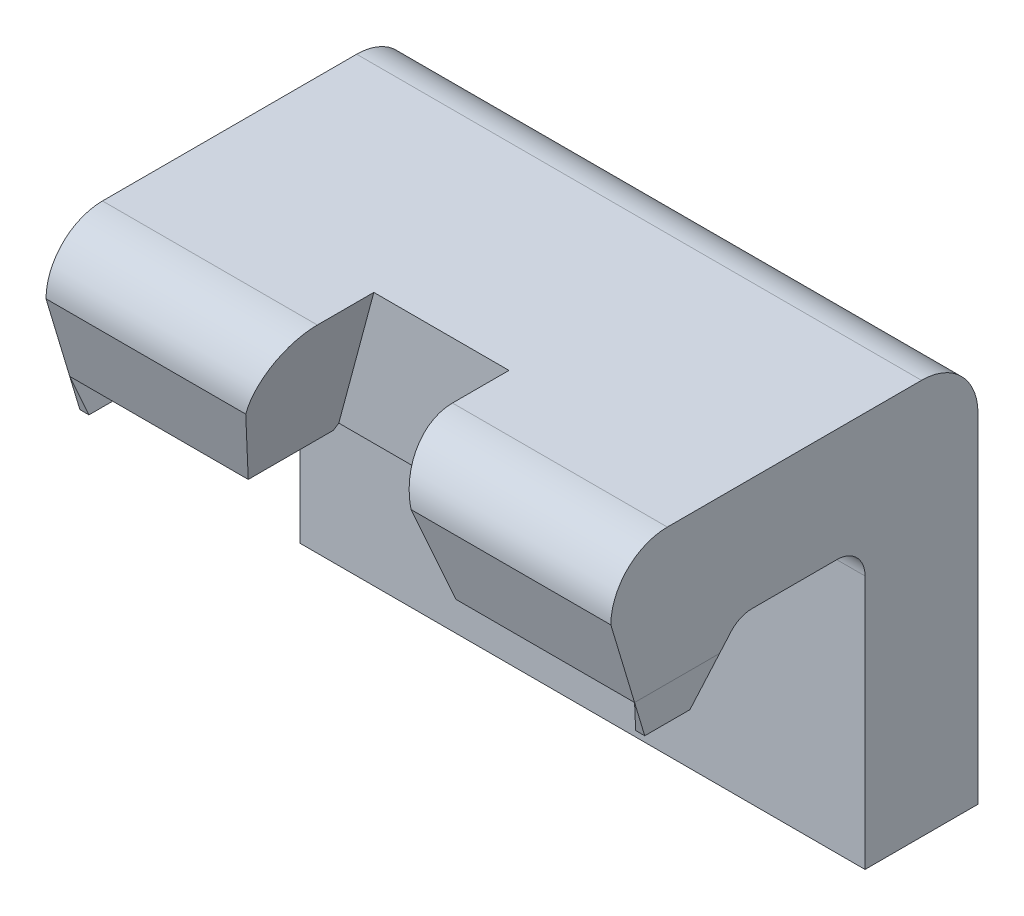
ISO-10303-21;
HEADER;
FILE_DESCRIPTION(('STEP AP214'),'2;1');
FILE_NAME('part.step','',(''),(''),'','','');
FILE_SCHEMA(('AUTOMOTIVE_DESIGN { 1 0 10303 214 1 1 1 1 }'));
ENDSEC;
DATA;
#1=APPLICATION_CONTEXT('core data for automotive mechanical design processes');
#2=APPLICATION_PROTOCOL_DEFINITION('international standard','automotive_design',2000,#1);
#3=PRODUCT_CONTEXT('',#1,'mechanical');
#4=PRODUCT('Part','Part','',(#3));
#5=PRODUCT_RELATED_PRODUCT_CATEGORY('part','',(#4));
#6=PRODUCT_DEFINITION_FORMATION('','',#4);
#7=PRODUCT_DEFINITION_CONTEXT('part definition',#1,'design');
#8=PRODUCT_DEFINITION('design','',#6,#7);
#9=PRODUCT_DEFINITION_SHAPE('','',#8);
#10=(LENGTH_UNIT() NAMED_UNIT(*) SI_UNIT(.MILLI.,.METRE.));
#11=(NAMED_UNIT(*) PLANE_ANGLE_UNIT() SI_UNIT($,.RADIAN.));
#12=(NAMED_UNIT(*) SI_UNIT($,.STERADIAN.) SOLID_ANGLE_UNIT());
#13=UNCERTAINTY_MEASURE_WITH_UNIT(LENGTH_MEASURE(1.E-05),#10,'distance_accuracy_value','');
#14=(GEOMETRIC_REPRESENTATION_CONTEXT(3) GLOBAL_UNCERTAINTY_ASSIGNED_CONTEXT((#13)) GLOBAL_UNIT_ASSIGNED_CONTEXT((#10,
#11,#12)) REPRESENTATION_CONTEXT('',''));
#15=CARTESIAN_POINT('',(0.,0.,0.));
#16=DIRECTION('',(0.,0.,1.));
#17=DIRECTION('',(1.,0.,0.));
#18=AXIS2_PLACEMENT_3D('',#15,#16,#17);
#19=CARTESIAN_POINT('',(0.2,0.4,0.45));
#20=DIRECTION('',(0.965925826288944,0.258819045102985,0.));
#21=DIRECTION('',(-0.258819045102985,0.965925826288944,0.));
#22=AXIS2_PLACEMENT_3D('',#19,#20,#21);
#23=PLANE('',#22);
#24=DIRECTION('',(0.,0.,1.));
#25=VECTOR('',#24,1.);
#26=CARTESIAN_POINT('',(0.183923048454,0.46,0.));
#27=LINE('',#26,#25);
#28=CARTESIAN_POINT('',(0.183923048454,0.459999999999874,0.457529003975784));
#29=VERTEX_POINT('',#28);
#30=CARTESIAN_POINT('',(0.183923048454,0.459999999999992,0.608000000000027));
#31=VERTEX_POINT('',#30);
#32=EDGE_CURVE('P0_E147',#29,#31,#27,.T.);
#33=ORIENTED_EDGE('',*,*,#32,.T.);
#34=DIRECTION('',(-0.248592126934948,0.927758448091751,0.278327534427235));
#35=VECTOR('',#34,1.);
#36=CARTESIAN_POINT('',(0.183923048454,0.459999999999988,0.60800000000004));
#37=LINE('',#36,#35);
#38=CARTESIAN_POINT('',(0.146410161513836,0.6,0.65));
#39=VERTEX_POINT('',#38);
#40=EDGE_CURVE('P0_E144',#31,#39,#37,.T.);
#41=ORIENTED_EDGE('',*,*,#40,.T.);
#42=CARTESIAN_POINT('',(0.146410161513672,0.6,0.55));
#43=DIRECTION('',(0.965925826288944,0.258819045102985,0.));
#44=DIRECTION('',(0.258819045102985,-0.965925826288944,0.));
#45=AXIS2_PLACEMENT_3D('',#42,#43,#44);
#46=ELLIPSE('',#45,0.103527618041022,0.1);
#47=CARTESIAN_POINT('',(0.119615242270754,0.7,0.55));
#48=VERTEX_POINT('',#47);
#49=EDGE_CURVE('P0_E20',#48,#39,#46,.T.);
#50=ORIENTED_EDGE('',*,*,#49,.F.);
#51=DIRECTION('',(0.,0.,1.));
#52=VECTOR('',#51,1.);
#53=CARTESIAN_POINT('',(0.119615242271,0.7,0.55));
#54=LINE('',#53,#52);
#55=CARTESIAN_POINT('',(0.119615242271,0.7,0.45));
#56=VERTEX_POINT('',#55);
#57=EDGE_CURVE('P0_E141',#56,#48,#54,.T.);
#58=ORIENTED_EDGE('',*,*,#57,.F.);
#59=DIRECTION('',(0.258819045101076,-0.965925826289455,0.));
#60=VECTOR('',#59,1.);
#61=CARTESIAN_POINT('',(0.119615242271,0.7,0.45));
#62=LINE('',#61,#60);
#63=CARTESIAN_POINT('',(0.181616184829,0.468609332255068,0.450000000000078));
#64=VERTEX_POINT('',#63);
#65=EDGE_CURVE('P0_E174',#56,#64,#62,.T.);
#66=ORIENTED_EDGE('',*,*,#65,.T.);
#67=DIRECTION('',(0.197718812609969,-0.737896654329067,0.645302873595085));
#68=VECTOR('',#67,1.);
#69=CARTESIAN_POINT('',(0.181616184829,0.468609332255103,0.450000000000117));
#70=LINE('',#69,#68);
#71=EDGE_CURVE('P0_E198',#64,#29,#70,.T.);
#72=ORIENTED_EDGE('',*,*,#71,.T.);
#73=EDGE_LOOP('',(#33,#41,#50,#58,#66,#72));
#74=FACE_BOUND('',#73,.T.);
#75=ADVANCED_FACE('P0_F17',(#74),#23,.F.);
#76=CARTESIAN_POINT('',(-0.2,0.4,0.45));
#77=DIRECTION('',(-0.965925826288944,0.258819045102985,0.));
#78=DIRECTION('',(-0.258819045102985,-0.965925826288944,0.));
#79=AXIS2_PLACEMENT_3D('',#76,#77,#78);
#80=PLANE('',#79);
#81=DIRECTION('',(0.197718812609969,0.737896654329067,-0.645302873595085));
#82=VECTOR('',#81,1.);
#83=CARTESIAN_POINT('',(-0.183923048454,0.459999999999811,0.457529003975784));
#84=LINE('',#83,#82);
#85=CARTESIAN_POINT('',(-0.183923048454,0.459999999999937,0.457529003975928));
#86=VERTEX_POINT('',#85);
#87=CARTESIAN_POINT('',(-0.181616184829,0.468609332255068,0.450000000000078));
#88=VERTEX_POINT('',#87);
#89=EDGE_CURVE('P0_E189',#86,#88,#84,.T.);
#90=ORIENTED_EDGE('',*,*,#89,.T.);
#91=DIRECTION('',(0.258819045101076,0.965925826289455,0.));
#92=VECTOR('',#91,1.);
#93=CARTESIAN_POINT('',(-0.181616184829,0.468609332255,0.45));
#94=LINE('',#93,#92);
#95=CARTESIAN_POINT('',(-0.119615242271,0.7,0.45));
#96=VERTEX_POINT('',#95);
#97=EDGE_CURVE('P0_E148',#88,#96,#94,.T.);
#98=ORIENTED_EDGE('',*,*,#97,.T.);
#99=DIRECTION('',(0.,0.,1.));
#100=VECTOR('',#99,1.);
#101=CARTESIAN_POINT('',(-0.119615242271,0.7,0.55));
#102=LINE('',#101,#100);
#103=CARTESIAN_POINT('',(-0.119615242270754,0.7,0.55));
#104=VERTEX_POINT('',#103);
#105=EDGE_CURVE('P0_E274',#104,#96,#102,.F.);
#106=ORIENTED_EDGE('',*,*,#105,.F.);
#107=CARTESIAN_POINT('',(-0.146410161513672,0.6,0.55));
#108=DIRECTION('',(-0.965925826288944,0.258819045102985,0.));
#109=DIRECTION('',(0.258819045102985,0.965925826288944,0.));
#110=AXIS2_PLACEMENT_3D('',#107,#108,#109);
#111=ELLIPSE('',#110,0.103527618041022,0.1);
#112=CARTESIAN_POINT('',(-0.146410161513836,0.6,0.65));
#113=VERTEX_POINT('',#112);
#114=EDGE_CURVE('P0_E166',#113,#104,#111,.T.);
#115=ORIENTED_EDGE('',*,*,#114,.F.);
#116=DIRECTION('',(-0.248592126934948,-0.927758448091751,-0.278327534427235));
#117=VECTOR('',#116,1.);
#118=CARTESIAN_POINT('',(-0.146410161514,0.6,0.65));
#119=LINE('',#118,#117);
#120=CARTESIAN_POINT('',(-0.183923048454,0.459999999999992,0.60800000000004));
#121=VERTEX_POINT('',#120);
#122=EDGE_CURVE('P0_E178',#113,#121,#119,.T.);
#123=ORIENTED_EDGE('',*,*,#122,.T.);
#124=DIRECTION('',(0.,0.,-1.));
#125=VECTOR('',#124,1.);
#126=CARTESIAN_POINT('',(-0.183923048454,0.46,0.));
#127=LINE('',#126,#125);
#128=EDGE_CURVE('P0_E181',#86,#121,#127,.F.);
#129=ORIENTED_EDGE('',*,*,#128,.F.);
#130=EDGE_LOOP('',(#90,#98,#106,#115,#123,#129));
#131=FACE_BOUND('',#130,.T.);
#132=ADVANCED_FACE('P0_F283',(#131),#80,.F.);
#133=CARTESIAN_POINT('',(0.119615242271,0.7,0.45));
#134=DIRECTION('',(0.,0.,-1.));
#135=DIRECTION('',(-1.,0.,0.));
#136=AXIS2_PLACEMENT_3D('',#133,#134,#135);
#137=PLANE('',#136);
#138=DIRECTION('',(1.,0.,0.));
#139=VECTOR('',#138,1.);
#140=CARTESIAN_POINT('',(-0.5,0.468609332255103,0.450000000000117));
#141=LINE('',#140,#139);
#142=EDGE_CURVE('P0_E191',#88,#64,#141,.T.);
#143=ORIENTED_EDGE('',*,*,#142,.T.);
#144=ORIENTED_EDGE('',*,*,#65,.F.);
#145=DIRECTION('',(1.,0.,0.));
#146=VECTOR('',#145,1.);
#147=CARTESIAN_POINT('',(-0.5,0.7,0.45));
#148=LINE('',#147,#146);
#149=EDGE_CURVE('P0_E162',#96,#56,#148,.T.);
#150=ORIENTED_EDGE('',*,*,#149,.F.);
#151=ORIENTED_EDGE('',*,*,#97,.F.);
#152=EDGE_LOOP('',(#143,#144,#150,#151));
#153=FACE_BOUND('',#152,.T.);
#154=ADVANCED_FACE('P0_F288',(#153),#137,.F.);
#155=CARTESIAN_POINT('',(-0.5,0.6,0.55));
#156=DIRECTION('',(1.,0.,0.));
#157=DIRECTION('',(0.,0.,-1.));
#158=AXIS2_PLACEMENT_3D('',#155,#156,#157);
#159=CYLINDRICAL_SURFACE('',#158,0.1);
#160=CARTESIAN_POINT('',(0.5,0.6,0.55));
#161=DIRECTION('',(1.,0.,0.));
#162=DIRECTION('',(0.,0.,-1.));
#163=AXIS2_PLACEMENT_3D('',#160,#161,#162);
#164=CIRCLE('',#163,0.1);
#165=CARTESIAN_POINT('',(0.5,0.6,0.65));
#166=VERTEX_POINT('',#165);
#167=CARTESIAN_POINT('',(0.5,0.7,0.55));
#168=VERTEX_POINT('',#167);
#169=EDGE_CURVE('P0_E153',#166,#168,#164,.F.);
#170=ORIENTED_EDGE('',*,*,#169,.T.);
#171=DIRECTION('',(1.,0.,0.));
#172=VECTOR('',#171,1.);
#173=CARTESIAN_POINT('',(-0.5,0.7,0.55));
#174=LINE('',#173,#172);
#175=EDGE_CURVE('P0_E150',#48,#168,#174,.T.);
#176=ORIENTED_EDGE('',*,*,#175,.F.);
#177=ORIENTED_EDGE('',*,*,#49,.T.);
#178=DIRECTION('',(1.,0.,0.));
#179=VECTOR('',#178,1.);
#180=CARTESIAN_POINT('',(-0.5,0.6,0.65));
#181=LINE('',#180,#179);
#182=EDGE_CURVE('P0_E195',#39,#166,#181,.T.);
#183=ORIENTED_EDGE('',*,*,#182,.T.);
#184=EDGE_LOOP('',(#170,#176,#177,#183));
#185=FACE_BOUND('',#184,.T.);
#186=ADVANCED_FACE('P0_F151',(#185),#159,.T.);
#187=CARTESIAN_POINT('',(0.,0.46,0.));
#188=DIRECTION('',(0.,1.,0.));
#189=DIRECTION('',(0.,0.,1.));
#190=AXIS2_PLACEMENT_3D('',#187,#188,#189);
#191=PLANE('',#190);
#192=DIRECTION('',(0.,0.,1.));
#193=VECTOR('',#192,1.);
#194=CARTESIAN_POINT('',(0.5,0.46,0.25));
#195=LINE('',#194,#193);
#196=CARTESIAN_POINT('',(0.5,0.459999999999937,0.457529003975928));
#197=VERTEX_POINT('',#196);
#198=CARTESIAN_POINT('',(0.5,0.459999999999996,0.608000000000014));
#199=VERTEX_POINT('',#198);
#200=EDGE_CURVE('P0_E266',#197,#199,#195,.T.);
#201=ORIENTED_EDGE('',*,*,#200,.T.);
#202=DIRECTION('',(1.,0.,0.));
#203=VECTOR('',#202,1.);
#204=CARTESIAN_POINT('',(-0.5,0.459999999999988,0.60800000000004));
#205=LINE('',#204,#203);
#206=EDGE_CURVE('P0_E208',#199,#31,#205,.F.);
#207=ORIENTED_EDGE('',*,*,#206,.T.);
#208=ORIENTED_EDGE('',*,*,#32,.F.);
#209=DIRECTION('',(1.,0.,0.));
#210=VECTOR('',#209,1.);
#211=CARTESIAN_POINT('',(-0.5,0.459999999999811,0.457529003975784));
#212=LINE('',#211,#210);
#213=EDGE_CURVE('P0_E200',#29,#197,#212,.T.);
#214=ORIENTED_EDGE('',*,*,#213,.T.);
#215=EDGE_LOOP('',(#201,#207,#208,#214));
#216=FACE_BOUND('',#215,.T.);
#217=ADVANCED_FACE('P0_F517',(#216),#191,.F.);
#218=CARTESIAN_POINT('',(-0.5,0.6,0.65));
#219=DIRECTION('',(0.,0.28734788556607,-0.957826285221234));
#220=DIRECTION('',(0.,0.957826285221234,0.28734788556607));
#221=AXIS2_PLACEMENT_3D('',#218,#219,#220);
#222=PLANE('',#221);
#223=ORIENTED_EDGE('',*,*,#206,.F.);
#224=DIRECTION('',(0.,0.957826285221151,0.287347885566346));
#225=VECTOR('',#224,1.);
#226=CARTESIAN_POINT('',(0.5,0.46,0.608));
#227=LINE('',#226,#225);
#228=EDGE_CURVE('P0_E268',#199,#166,#227,.T.);
#229=ORIENTED_EDGE('',*,*,#228,.T.);
#230=ORIENTED_EDGE('',*,*,#182,.F.);
#231=ORIENTED_EDGE('',*,*,#40,.F.);
#232=EDGE_LOOP('',(#223,#229,#230,#231));
#233=FACE_BOUND('',#232,.T.);
#234=ADVANCED_FACE('P0_F509',(#233),#222,.F.);
#235=CARTESIAN_POINT('',(-0.5,0.4,0.51));
#236=DIRECTION('',(0.,0.658298490474855,0.752756997601834));
#237=DIRECTION('',(0.,-0.752756997601834,0.658298490474855));
#238=AXIS2_PLACEMENT_3D('',#235,#236,#237);
#239=PLANE('',#238);
#240=DIRECTION('',(0.,-0.752756997602527,0.658298490474063));
#241=VECTOR('',#240,1.);
#242=CARTESIAN_POINT('',(-0.5,0.480327505632,0.439752262856));
#243=LINE('',#242,#241);
#244=CARTESIAN_POINT('',(-0.5,0.48032750563368,0.439752262854322));
#245=VERTEX_POINT('',#244);
#246=CARTESIAN_POINT('',(-0.5,0.46,0.457529003976));
#247=VERTEX_POINT('',#246);
#248=EDGE_CURVE('P0_E254',#245,#247,#243,.T.);
#249=ORIENTED_EDGE('',*,*,#248,.F.);
#250=DIRECTION('',(1.,0.,0.));
#251=VECTOR('',#250,1.);
#252=CARTESIAN_POINT('',(-0.5,0.480327505631809,0.43975226285575));
#253=LINE('',#252,#251);
#254=CARTESIAN_POINT('',(0.5,0.48032750563368,0.439752262854322));
#255=VERTEX_POINT('',#254);
#256=EDGE_CURVE('P0_E305',#245,#255,#253,.T.);
#257=ORIENTED_EDGE('',*,*,#256,.T.);
#258=DIRECTION('',(0.,-0.752756997602527,0.658298490474063));
#259=VECTOR('',#258,1.);
#260=CARTESIAN_POINT('',(0.5,0.480327505632,0.439752262856));
#261=LINE('',#260,#259);
#262=EDGE_CURVE('P0_E231',#255,#197,#261,.T.);
#263=ORIENTED_EDGE('',*,*,#262,.T.);
#264=ORIENTED_EDGE('',*,*,#213,.F.);
#265=ORIENTED_EDGE('',*,*,#71,.F.);
#266=ORIENTED_EDGE('',*,*,#142,.F.);
#267=ORIENTED_EDGE('',*,*,#89,.F.);
#268=DIRECTION('',(1.,0.,0.));
#269=VECTOR('',#268,1.);
#270=CARTESIAN_POINT('',(0.,0.46,0.457529003976));
#271=LINE('',#270,#269);
#272=EDGE_CURVE('P0_E186',#247,#86,#271,.T.);
#273=ORIENTED_EDGE('',*,*,#272,.F.);
#274=EDGE_LOOP('',(#249,#257,#263,#264,#265,#266,#267,#273));
#275=FACE_BOUND('',#274,.T.);
#276=ADVANCED_FACE('P0_F370',(#275),#239,.F.);
#277=CARTESIAN_POINT('',(0.,0.46,0.));
#278=DIRECTION('',(0.,-1.,0.));
#279=DIRECTION('',(0.,0.,-1.));
#280=AXIS2_PLACEMENT_3D('',#277,#278,#279);
#281=PLANE('',#280);
#282=DIRECTION('',(1.,0.,0.));
#283=VECTOR('',#282,1.);
#284=CARTESIAN_POINT('',(-0.5,0.459999999999988,0.60800000000004));
#285=LINE('',#284,#283);
#286=CARTESIAN_POINT('',(-0.5,0.459999999999996,0.608000000000014));
#287=VERTEX_POINT('',#286);
#288=EDGE_CURVE('P0_E180',#121,#287,#285,.F.);
#289=ORIENTED_EDGE('',*,*,#288,.T.);
#290=DIRECTION('',(0.,0.,1.));
#291=VECTOR('',#290,1.);
#292=CARTESIAN_POINT('',(-0.5,0.46,0.25));
#293=LINE('',#292,#291);
#294=EDGE_CURVE('P0_E251',#247,#287,#293,.T.);
#295=ORIENTED_EDGE('',*,*,#294,.F.);
#296=ORIENTED_EDGE('',*,*,#272,.T.);
#297=ORIENTED_EDGE('',*,*,#128,.T.);
#298=EDGE_LOOP('',(#289,#295,#296,#297));
#299=FACE_BOUND('',#298,.T.);
#300=ADVANCED_FACE('P0_F373',(#299),#281,.T.);
#301=CARTESIAN_POINT('',(-0.5,0.6,0.65));
#302=DIRECTION('',(0.,0.28734788556607,-0.957826285221234));
#303=DIRECTION('',(0.,0.957826285221234,0.28734788556607));
#304=AXIS2_PLACEMENT_3D('',#301,#302,#303);
#305=PLANE('',#304);
#306=ORIENTED_EDGE('',*,*,#122,.F.);
#307=DIRECTION('',(1.,0.,0.));
#308=VECTOR('',#307,1.);
#309=CARTESIAN_POINT('',(-0.5,0.6,0.65));
#310=LINE('',#309,#308);
#311=CARTESIAN_POINT('',(-0.5,0.6,0.65));
#312=VERTEX_POINT('',#311);
#313=EDGE_CURVE('P0_E163',#312,#113,#310,.T.);
#314=ORIENTED_EDGE('',*,*,#313,.F.);
#315=DIRECTION('',(0.,0.957826285221151,0.287347885566346));
#316=VECTOR('',#315,1.);
#317=CARTESIAN_POINT('',(-0.5,0.46,0.608));
#318=LINE('',#317,#316);
#319=EDGE_CURVE('P0_E227',#287,#312,#318,.T.);
#320=ORIENTED_EDGE('',*,*,#319,.F.);
#321=ORIENTED_EDGE('',*,*,#288,.F.);
#322=EDGE_LOOP('',(#306,#314,#320,#321));
#323=FACE_BOUND('',#322,.T.);
#324=ADVANCED_FACE('P0_F376',(#323),#305,.F.);
#325=CARTESIAN_POINT('',(-0.5,0.6,0.55));
#326=DIRECTION('',(1.,0.,0.));
#327=DIRECTION('',(0.,0.,-1.));
#328=AXIS2_PLACEMENT_3D('',#325,#326,#327);
#329=CYLINDRICAL_SURFACE('',#328,0.1);
#330=CARTESIAN_POINT('',(-0.5,0.6,0.55));
#331=DIRECTION('',(1.,0.,0.));
#332=DIRECTION('',(0.,0.,-1.));
#333=AXIS2_PLACEMENT_3D('',#330,#331,#332);
#334=CIRCLE('',#333,0.1);
#335=CARTESIAN_POINT('',(-0.5,0.7,0.55));
#336=VERTEX_POINT('',#335);
#337=EDGE_CURVE('P0_E224',#312,#336,#334,.F.);
#338=ORIENTED_EDGE('',*,*,#337,.F.);
#339=ORIENTED_EDGE('',*,*,#313,.T.);
#340=ORIENTED_EDGE('',*,*,#114,.T.);
#341=DIRECTION('',(1.,0.,0.));
#342=VECTOR('',#341,1.);
#343=CARTESIAN_POINT('',(-0.5,0.7,0.55));
#344=LINE('',#343,#342);
#345=EDGE_CURVE('P0_E156',#336,#104,#344,.T.);
#346=ORIENTED_EDGE('',*,*,#345,.F.);
#347=EDGE_LOOP('',(#338,#339,#340,#346));
#348=FACE_BOUND('',#347,.T.);
#349=ADVANCED_FACE('P0_F377',(#348),#329,.T.);
#350=CARTESIAN_POINT('',(-0.5,0.7,0.55));
#351=DIRECTION('',(0.,1.,0.));
#352=DIRECTION('',(0.,0.,1.));
#353=AXIS2_PLACEMENT_3D('',#350,#351,#352);
#354=PLANE('',#353);
#355=ORIENTED_EDGE('',*,*,#105,.T.);
#356=ORIENTED_EDGE('',*,*,#149,.T.);
#357=ORIENTED_EDGE('',*,*,#57,.T.);
#358=ORIENTED_EDGE('',*,*,#175,.T.);
#359=DIRECTION('',(0.,0.,1.));
#360=VECTOR('',#359,1.);
#361=CARTESIAN_POINT('',(0.5,0.7,0.25));
#362=LINE('',#361,#360);
#363=CARTESIAN_POINT('',(0.5,0.7,0.1));
#364=VERTEX_POINT('',#363);
#365=EDGE_CURVE('P0_E238',#168,#364,#362,.F.);
#366=ORIENTED_EDGE('',*,*,#365,.T.);
#367=DIRECTION('',(1.,0.,0.));
#368=VECTOR('',#367,1.);
#369=CARTESIAN_POINT('',(-0.5,0.7,0.1));
#370=LINE('',#369,#368);
#371=CARTESIAN_POINT('',(-0.5,0.7,0.1));
#372=VERTEX_POINT('',#371);
#373=EDGE_CURVE('P0_E239',#372,#364,#370,.T.);
#374=ORIENTED_EDGE('',*,*,#373,.F.);
#375=DIRECTION('',(0.,0.,1.));
#376=VECTOR('',#375,1.);
#377=CARTESIAN_POINT('',(-0.5,0.7,0.25));
#378=LINE('',#377,#376);
#379=EDGE_CURVE('P0_E223',#336,#372,#378,.F.);
#380=ORIENTED_EDGE('',*,*,#379,.F.);
#381=ORIENTED_EDGE('',*,*,#345,.T.);
#382=EDGE_LOOP('',(#355,#356,#357,#358,#366,#374,#380,#381));
#383=FACE_BOUND('',#382,.T.);
#384=ADVANCED_FACE('P0_F160',(#383),#354,.T.);
#385=CARTESIAN_POINT('',(-0.5,0.,0.2));
#386=DIRECTION('',(0.,0.,1.));
#387=DIRECTION('',(1.,0.,0.));
#388=AXIS2_PLACEMENT_3D('',#385,#386,#387);
#389=PLANE('',#388);
#390=DIRECTION('',(1.,0.,0.));
#391=VECTOR('',#390,1.);
#392=CARTESIAN_POINT('',(-0.5,0.45,0.2));
#393=LINE('',#392,#391);
#394=CARTESIAN_POINT('',(0.5,0.45,0.2));
#395=VERTEX_POINT('',#394);
#396=CARTESIAN_POINT('',(-0.5,0.45,0.2));
#397=VERTEX_POINT('',#396);
#398=EDGE_CURVE('P0_E279',#395,#397,#393,.F.);
#399=ORIENTED_EDGE('',*,*,#398,.T.);
#400=DIRECTION('',(0.,1.,0.));
#401=VECTOR('',#400,1.);
#402=CARTESIAN_POINT('',(-0.5,0.45,0.2));
#403=LINE('',#402,#401);
#404=CARTESIAN_POINT('',(-0.5,0.,0.2));
#405=VERTEX_POINT('',#404);
#406=EDGE_CURVE('P0_E219',#405,#397,#403,.T.);
#407=ORIENTED_EDGE('',*,*,#406,.F.);
#408=DIRECTION('',(1.,0.,0.));
#409=VECTOR('',#408,1.);
#410=CARTESIAN_POINT('',(-0.5,0.,0.2));
#411=LINE('',#410,#409);
#412=CARTESIAN_POINT('',(0.5,0.,0.2));
#413=VERTEX_POINT('',#412);
#414=EDGE_CURVE('P0_E298',#413,#405,#411,.F.);
#415=ORIENTED_EDGE('',*,*,#414,.F.);
#416=DIRECTION('',(0.,1.,0.));
#417=VECTOR('',#416,1.);
#418=CARTESIAN_POINT('',(0.5,0.45,0.2));
#419=LINE('',#418,#417);
#420=EDGE_CURVE('P0_E235',#413,#395,#419,.T.);
#421=ORIENTED_EDGE('',*,*,#420,.T.);
#422=EDGE_LOOP('',(#399,#407,#415,#421));
#423=FACE_BOUND('',#422,.T.);
#424=ADVANCED_FACE('P0_F392',(#423),#389,.T.);
#425=CARTESIAN_POINT('',(-0.5,0.45,0.25));
#426=DIRECTION('',(1.,0.,0.));
#427=DIRECTION('',(0.,0.,-1.));
#428=AXIS2_PLACEMENT_3D('',#425,#426,#427);
#429=CYLINDRICAL_SURFACE('',#428,0.05);
#430=DIRECTION('',(1.,0.,0.));
#431=VECTOR('',#430,1.);
#432=CARTESIAN_POINT('',(-0.5,0.5,0.25));
#433=LINE('',#432,#431);
#434=CARTESIAN_POINT('',(-0.5,0.5,0.25));
#435=VERTEX_POINT('',#434);
#436=CARTESIAN_POINT('',(0.5,0.5,0.25));
#437=VERTEX_POINT('',#436);
#438=EDGE_CURVE('P0_E302',#435,#437,#433,.T.);
#439=ORIENTED_EDGE('',*,*,#438,.F.);
#440=CARTESIAN_POINT('',(-0.5,0.45,0.25));
#441=DIRECTION('',(1.,0.,0.));
#442=DIRECTION('',(0.,0.,-1.));
#443=AXIS2_PLACEMENT_3D('',#440,#441,#442);
#444=CIRCLE('',#443,0.05);
#445=EDGE_CURVE('P0_E216',#397,#435,#444,.T.);
#446=ORIENTED_EDGE('',*,*,#445,.F.);
#447=ORIENTED_EDGE('',*,*,#398,.F.);
#448=CARTESIAN_POINT('',(0.5,0.45,0.25));
#449=DIRECTION('',(1.,0.,0.));
#450=DIRECTION('',(0.,0.,-1.));
#451=AXIS2_PLACEMENT_3D('',#448,#449,#450);
#452=CIRCLE('',#451,0.05);
#453=EDGE_CURVE('P0_E233',#395,#437,#452,.T.);
#454=ORIENTED_EDGE('',*,*,#453,.T.);
#455=EDGE_LOOP('',(#439,#446,#447,#454));
#456=FACE_BOUND('',#455,.T.);
#457=ADVANCED_FACE('P0_F394',(#456),#429,.F.);
#458=CARTESIAN_POINT('',(-0.5,0.5,0.25));
#459=DIRECTION('',(0.,-1.,0.));
#460=DIRECTION('',(0.,0.,-1.));
#461=AXIS2_PLACEMENT_3D('',#458,#459,#460);
#462=PLANE('',#461);
#463=DIRECTION('',(1.,0.,0.));
#464=VECTOR('',#463,1.);
#465=CARTESIAN_POINT('',(-0.5,0.5,0.4));
#466=LINE('',#465,#464);
#467=CARTESIAN_POINT('',(0.5,0.5,0.4));
#468=VERTEX_POINT('',#467);
#469=CARTESIAN_POINT('',(-0.5,0.5,0.4));
#470=VERTEX_POINT('',#469);
#471=EDGE_CURVE('P0_E295',#468,#470,#466,.F.);
#472=ORIENTED_EDGE('',*,*,#471,.T.);
#473=DIRECTION('',(0.,0.,1.));
#474=VECTOR('',#473,1.);
#475=CARTESIAN_POINT('',(-0.5,0.5,0.25));
#476=LINE('',#475,#474);
#477=EDGE_CURVE('P0_E215',#435,#470,#476,.T.);
#478=ORIENTED_EDGE('',*,*,#477,.F.);
#479=ORIENTED_EDGE('',*,*,#438,.T.);
#480=DIRECTION('',(0.,0.,1.));
#481=VECTOR('',#480,1.);
#482=CARTESIAN_POINT('',(0.5,0.5,0.25));
#483=LINE('',#482,#481);
#484=EDGE_CURVE('P0_E232',#437,#468,#483,.T.);
#485=ORIENTED_EDGE('',*,*,#484,.T.);
#486=EDGE_LOOP('',(#472,#478,#479,#485));
#487=FACE_BOUND('',#486,.T.);
#488=ADVANCED_FACE('P0_F361',(#487),#462,.T.);
#489=CARTESIAN_POINT('',(-0.5,0.45,0.4));
#490=DIRECTION('',(1.,0.,0.));
#491=DIRECTION('',(0.,0.,-1.));
#492=AXIS2_PLACEMENT_3D('',#489,#490,#491);
#493=CYLINDRICAL_SURFACE('',#492,0.05);
#494=ORIENTED_EDGE('',*,*,#471,.F.);
#495=CARTESIAN_POINT('',(0.5,0.45,0.4));
#496=DIRECTION('',(1.,0.,0.));
#497=DIRECTION('',(0.,0.,-1.));
#498=AXIS2_PLACEMENT_3D('',#495,#496,#497);
#499=CIRCLE('',#498,0.05);
#500=EDGE_CURVE('P0_E228',#468,#255,#499,.T.);
#501=ORIENTED_EDGE('',*,*,#500,.T.);
#502=ORIENTED_EDGE('',*,*,#256,.F.);
#503=CARTESIAN_POINT('',(-0.5,0.45,0.4));
#504=DIRECTION('',(1.,0.,0.));
#505=DIRECTION('',(0.,0.,-1.));
#506=AXIS2_PLACEMENT_3D('',#503,#504,#505);
#507=CIRCLE('',#506,0.05);
#508=EDGE_CURVE('P0_E211',#470,#245,#507,.T.);
#509=ORIENTED_EDGE('',*,*,#508,.F.);
#510=EDGE_LOOP('',(#494,#501,#502,#509));
#511=FACE_BOUND('',#510,.T.);
#512=ADVANCED_FACE('P0_F367',(#511),#493,.F.);
#513=CARTESIAN_POINT('',(-0.5,0.6,0.1));
#514=DIRECTION('',(1.,0.,0.));
#515=DIRECTION('',(0.,0.,-1.));
#516=AXIS2_PLACEMENT_3D('',#513,#514,#515);
#517=CYLINDRICAL_SURFACE('',#516,0.1);
#518=DIRECTION('',(-1.,0.,0.));
#519=VECTOR('',#518,1.);
#520=CARTESIAN_POINT('',(-0.5,0.6,0.));
#521=LINE('',#520,#519);
#522=CARTESIAN_POINT('',(-0.5,0.6,0.));
#523=VERTEX_POINT('',#522);
#524=CARTESIAN_POINT('',(0.5,0.6,0.));
#525=VERTEX_POINT('',#524);
#526=EDGE_CURVE('P0_E214',#523,#525,#521,.F.);
#527=ORIENTED_EDGE('',*,*,#526,.F.);
#528=CARTESIAN_POINT('',(-0.5,0.6,0.1));
#529=DIRECTION('',(1.,0.,0.));
#530=DIRECTION('',(0.,0.,-1.));
#531=AXIS2_PLACEMENT_3D('',#528,#529,#530);
#532=CIRCLE('',#531,0.1);
#533=EDGE_CURVE('P0_E220',#372,#523,#532,.F.);
#534=ORIENTED_EDGE('',*,*,#533,.F.);
#535=ORIENTED_EDGE('',*,*,#373,.T.);
#536=CARTESIAN_POINT('',(0.5,0.6,0.1));
#537=DIRECTION('',(1.,0.,0.));
#538=DIRECTION('',(0.,0.,-1.));
#539=AXIS2_PLACEMENT_3D('',#536,#537,#538);
#540=CIRCLE('',#539,0.1);
#541=EDGE_CURVE('P0_E236',#364,#525,#540,.F.);
#542=ORIENTED_EDGE('',*,*,#541,.T.);
#543=EDGE_LOOP('',(#527,#534,#535,#542));
#544=FACE_BOUND('',#543,.T.);
#545=ADVANCED_FACE('P0_F415',(#544),#517,.T.);
#546=CARTESIAN_POINT('',(0.5,0.45,0.25));
#547=DIRECTION('',(-1.,0.,0.));
#548=DIRECTION('',(0.,0.,1.));
#549=AXIS2_PLACEMENT_3D('',#546,#547,#548);
#550=PLANE('',#549);
#551=ORIENTED_EDGE('',*,*,#200,.F.);
#552=ORIENTED_EDGE('',*,*,#262,.F.);
#553=ORIENTED_EDGE('',*,*,#500,.F.);
#554=ORIENTED_EDGE('',*,*,#484,.F.);
#555=ORIENTED_EDGE('',*,*,#453,.F.);
#556=ORIENTED_EDGE('',*,*,#420,.F.);
#557=DIRECTION('',(0.,0.,-1.));
#558=VECTOR('',#557,1.);
#559=CARTESIAN_POINT('',(0.5,0.,0.));
#560=LINE('',#559,#558);
#561=CARTESIAN_POINT('',(0.5,0.,0.));
#562=VERTEX_POINT('',#561);
#563=EDGE_CURVE('P0_E300',#562,#413,#560,.F.);
#564=ORIENTED_EDGE('',*,*,#563,.F.);
#565=DIRECTION('',(0.,1.,0.));
#566=VECTOR('',#565,1.);
#567=CARTESIAN_POINT('',(0.5,0.6,0.));
#568=LINE('',#567,#566);
#569=EDGE_CURVE('P0_E323',#525,#562,#568,.F.);
#570=ORIENTED_EDGE('',*,*,#569,.F.);
#571=ORIENTED_EDGE('',*,*,#541,.F.);
#572=ORIENTED_EDGE('',*,*,#365,.F.);
#573=ORIENTED_EDGE('',*,*,#169,.F.);
#574=ORIENTED_EDGE('',*,*,#228,.F.);
#575=EDGE_LOOP('',(#551,#552,#553,#554,#555,#556,#564,#570,#571,#572,#573,#574));
#576=FACE_BOUND('',#575,.T.);
#577=ADVANCED_FACE('P0_F387',(#576),#550,.F.);
#578=CARTESIAN_POINT('',(-0.5,0.,0.));
#579=DIRECTION('',(0.,-1.,0.));
#580=DIRECTION('',(0.,0.,-1.));
#581=AXIS2_PLACEMENT_3D('',#578,#579,#580);
#582=PLANE('',#581);
#583=ORIENTED_EDGE('',*,*,#414,.T.);
#584=DIRECTION('',(0.,0.,1.));
#585=VECTOR('',#584,1.);
#586=CARTESIAN_POINT('',(-0.5,0.,0.25));
#587=LINE('',#586,#585);
#588=CARTESIAN_POINT('',(-0.5,0.,0.));
#589=VERTEX_POINT('',#588);
#590=EDGE_CURVE('P0_E35',#589,#405,#587,.T.);
#591=ORIENTED_EDGE('',*,*,#590,.F.);
#592=DIRECTION('',(-1.,0.,0.));
#593=VECTOR('',#592,1.);
#594=CARTESIAN_POINT('',(-0.5,0.,0.));
#595=LINE('',#594,#593);
#596=EDGE_CURVE('P0_E26',#562,#589,#595,.T.);
#597=ORIENTED_EDGE('',*,*,#596,.F.);
#598=ORIENTED_EDGE('',*,*,#563,.T.);
#599=EDGE_LOOP('',(#583,#591,#597,#598));
#600=FACE_BOUND('',#599,.T.);
#601=ADVANCED_FACE('P0_F383',(#600),#582,.T.);
#602=CARTESIAN_POINT('',(-0.5,0.45,0.25));
#603=DIRECTION('',(-1.,0.,0.));
#604=DIRECTION('',(0.,0.,1.));
#605=AXIS2_PLACEMENT_3D('',#602,#603,#604);
#606=PLANE('',#605);
#607=ORIENTED_EDGE('',*,*,#477,.T.);
#608=ORIENTED_EDGE('',*,*,#508,.T.);
#609=ORIENTED_EDGE('',*,*,#248,.T.);
#610=ORIENTED_EDGE('',*,*,#294,.T.);
#611=ORIENTED_EDGE('',*,*,#319,.T.);
#612=ORIENTED_EDGE('',*,*,#337,.T.);
#613=ORIENTED_EDGE('',*,*,#379,.T.);
#614=ORIENTED_EDGE('',*,*,#533,.T.);
#615=DIRECTION('',(0.,1.,0.));
#616=VECTOR('',#615,1.);
#617=CARTESIAN_POINT('',(-0.5,0.6,0.));
#618=LINE('',#617,#616);
#619=EDGE_CURVE('P0_E11',#589,#523,#618,.T.);
#620=ORIENTED_EDGE('',*,*,#619,.F.);
#621=ORIENTED_EDGE('',*,*,#590,.T.);
#622=ORIENTED_EDGE('',*,*,#406,.T.);
#623=ORIENTED_EDGE('',*,*,#445,.T.);
#624=EDGE_LOOP('',(#607,#608,#609,#610,#611,#612,#613,#614,#620,#621,#622,#623));
#625=FACE_BOUND('',#624,.T.);
#626=ADVANCED_FACE('P0_F357',(#625),#606,.T.);
#627=CARTESIAN_POINT('',(-0.5,0.6,0.));
#628=DIRECTION('',(0.,0.,-1.));
#629=DIRECTION('',(-1.,0.,0.));
#630=AXIS2_PLACEMENT_3D('',#627,#628,#629);
#631=PLANE('',#630);
#632=ORIENTED_EDGE('',*,*,#596,.T.);
#633=ORIENTED_EDGE('',*,*,#619,.T.);
#634=ORIENTED_EDGE('',*,*,#526,.T.);
#635=ORIENTED_EDGE('',*,*,#569,.T.);
#636=EDGE_LOOP('',(#632,#633,#634,#635));
#637=FACE_BOUND('',#636,.T.);
#638=ADVANCED_FACE('P0_F381',(#637),#631,.T.);
#639=CLOSED_SHELL('',(#75,#132,#154,#186,#217,#234,#276,#300,#324,#349,#384,#424,#457,#488,#512,
#545,#577,#601,#626,#638));
#640=MANIFOLD_SOLID_BREP('P0_B1',#639);
#641=CARTESIAN_POINT('',(-0.5,0.6,0.65));
#642=DIRECTION('',(0.,0.28734788556607,-0.957826285221234));
#643=DIRECTION('',(0.,0.957826285221234,0.28734788556607));
#644=AXIS2_PLACEMENT_3D('',#641,#642,#643);
#645=PLANE('',#644);
#646=DIRECTION('',(-0.248592126937625,-0.927758448091046,-0.278327534427196));
#647=VECTOR('',#646,1.);
#648=CARTESIAN_POINT('',(0.5,0.46,0.608));
#649=LINE('',#648,#647);
#650=CARTESIAN_POINT('',(0.5,0.459999999999994,0.60800000000002));
#651=VERTEX_POINT('',#650);
#652=CARTESIAN_POINT('',(0.483923048454024,0.399999999999985,0.590000000000029));
#653=VERTEX_POINT('',#652);
#654=EDGE_CURVE('P1_E69',#651,#653,#649,.T.);
#655=ORIENTED_EDGE('',*,*,#654,.T.);
#656=DIRECTION('',(1.,0.,0.));
#657=VECTOR('',#656,1.);
#658=CARTESIAN_POINT('',(-0.5,0.4,0.59));
#659=LINE('',#658,#657);
#660=CARTESIAN_POINT('',(0.5,0.399999999999996,0.590000000000014));
#661=VERTEX_POINT('',#660);
#662=EDGE_CURVE('P1_E20',#661,#653,#659,.F.);
#663=ORIENTED_EDGE('',*,*,#662,.F.);
#664=DIRECTION('',(0.,0.957826285221152,0.287347885566346));
#665=VECTOR('',#664,1.);
#666=CARTESIAN_POINT('',(0.5,0.4,0.59));
#667=LINE('',#666,#665);
#668=EDGE_CURVE('P1_E63',#661,#651,#667,.T.);
#669=ORIENTED_EDGE('',*,*,#668,.T.);
#670=EDGE_LOOP('',(#655,#663,#669));
#671=FACE_BOUND('',#670,.T.);
#672=ADVANCED_FACE('P1_F17',(#671),#645,.F.);
#673=CARTESIAN_POINT('',(-0.5,0.4,0.65));
#674=DIRECTION('',(0.,-1.,0.));
#675=DIRECTION('',(0.,0.,-1.));
#676=AXIS2_PLACEMENT_3D('',#673,#674,#675);
#677=PLANE('',#676);
#678=DIRECTION('',(0.,0.,1.));
#679=VECTOR('',#678,1.);
#680=CARTESIAN_POINT('',(0.5,0.4,0.25));
#681=LINE('',#680,#679);
#682=CARTESIAN_POINT('',(0.5,0.4,0.51));
#683=VERTEX_POINT('',#682);
#684=EDGE_CURVE('P1_E56',#683,#661,#681,.T.);
#685=ORIENTED_EDGE('',*,*,#684,.T.);
#686=ORIENTED_EDGE('',*,*,#662,.T.);
#687=DIRECTION('',(0.,0.,1.));
#688=VECTOR('',#687,1.);
#689=CARTESIAN_POINT('',(0.483923048454095,0.399999999999975,0.608));
#690=LINE('',#689,#688);
#691=CARTESIAN_POINT('',(0.483923048454024,0.399999999999994,0.51));
#692=VERTEX_POINT('',#691);
#693=EDGE_CURVE('P1_E58',#653,#692,#690,.F.);
#694=ORIENTED_EDGE('',*,*,#693,.T.);
#695=DIRECTION('',(1.,0.,0.));
#696=VECTOR('',#695,1.);
#697=CARTESIAN_POINT('',(-0.5,0.4,0.51));
#698=LINE('',#697,#696);
#699=EDGE_CURVE('P1_E54',#692,#683,#698,.T.);
#700=ORIENTED_EDGE('',*,*,#699,.T.);
#701=EDGE_LOOP('',(#685,#686,#694,#700));
#702=FACE_BOUND('',#701,.T.);
#703=ADVANCED_FACE('P1_F55',(#702),#677,.T.);
#704=CARTESIAN_POINT('',(-0.5,0.4,0.51));
#705=DIRECTION('',(0.,0.658298490474855,0.752756997601834));
#706=DIRECTION('',(0.,-0.752756997601834,0.658298490474855));
#707=AXIS2_PLACEMENT_3D('',#704,#705,#706);
#708=PLANE('',#707);
#709=DIRECTION('',(0.197718812625508,0.737896654329169,-0.645302873590207));
#710=VECTOR('',#709,1.);
#711=CARTESIAN_POINT('',(0.483923048454095,0.399999999999975,0.51));
#712=LINE('',#711,#710);
#713=CARTESIAN_POINT('',(0.5,0.459999999999906,0.457529003975892));
#714=VERTEX_POINT('',#713);
#715=EDGE_CURVE('P1_E26',#692,#714,#712,.T.);
#716=ORIENTED_EDGE('',*,*,#715,.T.);
#717=DIRECTION('',(0.,-0.752756997604206,0.658298490472142));
#718=VECTOR('',#717,1.);
#719=CARTESIAN_POINT('',(0.5,0.46,0.457529003976));
#720=LINE('',#719,#718);
#721=EDGE_CURVE('P1_E34',#714,#683,#720,.T.);
#722=ORIENTED_EDGE('',*,*,#721,.T.);
#723=ORIENTED_EDGE('',*,*,#699,.F.);
#724=EDGE_LOOP('',(#716,#722,#723));
#725=FACE_BOUND('',#724,.T.);
#726=ADVANCED_FACE('P1_F65',(#725),#708,.F.);
#727=CARTESIAN_POINT('',(0.5,0.45,0.25));
#728=DIRECTION('',(-1.,0.,0.));
#729=DIRECTION('',(0.,0.,1.));
#730=AXIS2_PLACEMENT_3D('',#727,#728,#729);
#731=PLANE('',#730);
#732=ORIENTED_EDGE('',*,*,#668,.F.);
#733=ORIENTED_EDGE('',*,*,#684,.F.);
#734=ORIENTED_EDGE('',*,*,#721,.F.);
#735=DIRECTION('',(0.,0.,1.));
#736=VECTOR('',#735,1.);
#737=CARTESIAN_POINT('',(0.5,0.46,0.608));
#738=LINE('',#737,#736);
#739=EDGE_CURVE('P1_E11',#714,#651,#738,.T.);
#740=ORIENTED_EDGE('',*,*,#739,.T.);
#741=EDGE_LOOP('',(#732,#733,#734,#740));
#742=FACE_BOUND('',#741,.T.);
#743=ADVANCED_FACE('P1_F62',(#742),#731,.F.);
#744=CARTESIAN_POINT('',(0.5,0.46,0.608));
#745=DIRECTION('',(0.965925826288944,-0.258819045102985,0.));
#746=DIRECTION('',(0.258819045102985,0.965925826288944,0.));
#747=AXIS2_PLACEMENT_3D('',#744,#745,#746);
#748=PLANE('',#747);
#749=ORIENTED_EDGE('',*,*,#715,.F.);
#750=ORIENTED_EDGE('',*,*,#693,.F.);
#751=ORIENTED_EDGE('',*,*,#654,.F.);
#752=ORIENTED_EDGE('',*,*,#739,.F.);
#753=EDGE_LOOP('',(#749,#750,#751,#752));
#754=FACE_BOUND('',#753,.T.);
#755=ADVANCED_FACE('P1_F73',(#754),#748,.F.);
#756=CLOSED_SHELL('',(#672,#703,#726,#743,#755));
#757=MANIFOLD_SOLID_BREP('P1_B1',#756);
#758=CARTESIAN_POINT('',(-0.5,0.6,0.65));
#759=DIRECTION('',(0.,0.28734788556607,-0.957826285221234));
#760=DIRECTION('',(0.,0.957826285221234,0.28734788556607));
#761=AXIS2_PLACEMENT_3D('',#758,#759,#760);
#762=PLANE('',#761);
#763=DIRECTION('',(-0.248592126937625,0.927758448091046,0.278327534427196));
#764=VECTOR('',#763,1.);
#765=CARTESIAN_POINT('',(-0.483923048454095,0.399999999999975,0.59));
#766=LINE('',#765,#764);
#767=CARTESIAN_POINT('',(-0.483923048454024,0.399999999999985,0.590000000000029));
#768=VERTEX_POINT('',#767);
#769=CARTESIAN_POINT('',(-0.5,0.459999999999994,0.60800000000002));
#770=VERTEX_POINT('',#769);
#771=EDGE_CURVE('P2_E57',#768,#770,#766,.T.);
#772=ORIENTED_EDGE('',*,*,#771,.T.);
#773=DIRECTION('',(0.,0.957826285221152,0.287347885566346));
#774=VECTOR('',#773,1.);
#775=CARTESIAN_POINT('',(-0.5,0.4,0.59));
#776=LINE('',#775,#774);
#777=CARTESIAN_POINT('',(-0.5,0.399999999999991,0.590000000000029));
#778=VERTEX_POINT('',#777);
#779=EDGE_CURVE('P2_E20',#778,#770,#776,.T.);
#780=ORIENTED_EDGE('',*,*,#779,.F.);
#781=DIRECTION('',(1.,0.,0.));
#782=VECTOR('',#781,1.);
#783=CARTESIAN_POINT('',(-0.5,0.4,0.59));
#784=LINE('',#783,#782);
#785=EDGE_CURVE('P2_E50',#768,#778,#784,.F.);
#786=ORIENTED_EDGE('',*,*,#785,.F.);
#787=EDGE_LOOP('',(#772,#780,#786));
#788=FACE_BOUND('',#787,.T.);
#789=ADVANCED_FACE('P2_F17',(#788),#762,.F.);
#790=CARTESIAN_POINT('',(-0.5,0.45,0.25));
#791=DIRECTION('',(-1.,0.,0.));
#792=DIRECTION('',(0.,0.,1.));
#793=AXIS2_PLACEMENT_3D('',#790,#791,#792);
#794=PLANE('',#793);
#795=DIRECTION('',(0.,0.,-1.));
#796=VECTOR('',#795,1.);
#797=CARTESIAN_POINT('',(-0.5,0.4,0.65));
#798=LINE('',#797,#796);
#799=CARTESIAN_POINT('',(-0.5,0.4,0.51));
#800=VERTEX_POINT('',#799);
#801=EDGE_CURVE('P2_E47',#778,#800,#798,.T.);
#802=ORIENTED_EDGE('',*,*,#801,.F.);
#803=ORIENTED_EDGE('',*,*,#779,.T.);
#804=DIRECTION('',(0.,0.,1.));
#805=VECTOR('',#804,1.);
#806=CARTESIAN_POINT('',(-0.5,0.46,0.608));
#807=LINE('',#806,#805);
#808=CARTESIAN_POINT('',(-0.5,0.459999999999953,0.457529003975946));
#809=VERTEX_POINT('',#808);
#810=EDGE_CURVE('P2_E66',#770,#809,#807,.F.);
#811=ORIENTED_EDGE('',*,*,#810,.T.);
#812=DIRECTION('',(0.,-0.752756997601834,0.658298490474855));
#813=VECTOR('',#812,1.);
#814=CARTESIAN_POINT('',(-0.5,0.4,0.51));
#815=LINE('',#814,#813);
#816=EDGE_CURVE('P2_E55',#809,#800,#815,.T.);
#817=ORIENTED_EDGE('',*,*,#816,.T.);
#818=EDGE_LOOP('',(#802,#803,#811,#817));
#819=FACE_BOUND('',#818,.T.);
#820=ADVANCED_FACE('P2_F61',(#819),#794,.T.);
#821=CARTESIAN_POINT('',(-0.5,0.4,0.51));
#822=DIRECTION('',(0.,0.658298490474855,0.752756997601834));
#823=DIRECTION('',(0.,-0.752756997601834,0.658298490474855));
#824=AXIS2_PLACEMENT_3D('',#821,#822,#823);
#825=PLANE('',#824);
#826=DIRECTION('',(0.197718812625508,-0.737896654329169,0.645302873590207));
#827=VECTOR('',#826,1.);
#828=CARTESIAN_POINT('',(-0.5,0.46,0.457529003976));
#829=LINE('',#828,#827);
#830=CARTESIAN_POINT('',(-0.483923048454024,0.399999999999994,0.51));
#831=VERTEX_POINT('',#830);
#832=EDGE_CURVE('P2_E26',#809,#831,#829,.T.);
#833=ORIENTED_EDGE('',*,*,#832,.T.);
#834=DIRECTION('',(1.,0.,0.));
#835=VECTOR('',#834,1.);
#836=CARTESIAN_POINT('',(-0.5,0.4,0.51));
#837=LINE('',#836,#835);
#838=EDGE_CURVE('P2_E34',#800,#831,#837,.T.);
#839=ORIENTED_EDGE('',*,*,#838,.F.);
#840=ORIENTED_EDGE('',*,*,#816,.F.);
#841=EDGE_LOOP('',(#833,#839,#840));
#842=FACE_BOUND('',#841,.T.);
#843=ADVANCED_FACE('P2_F71',(#842),#825,.F.);
#844=CARTESIAN_POINT('',(-0.5,0.4,0.65));
#845=DIRECTION('',(0.,-1.,0.));
#846=DIRECTION('',(0.,0.,-1.));
#847=AXIS2_PLACEMENT_3D('',#844,#845,#846);
#848=PLANE('',#847);
#849=ORIENTED_EDGE('',*,*,#801,.T.);
#850=ORIENTED_EDGE('',*,*,#838,.T.);
#851=DIRECTION('',(0.,0.,1.));
#852=VECTOR('',#851,1.);
#853=CARTESIAN_POINT('',(-0.483923048454095,0.399999999999975,0.608));
#854=LINE('',#853,#852);
#855=EDGE_CURVE('P2_E11',#831,#768,#854,.T.);
#856=ORIENTED_EDGE('',*,*,#855,.T.);
#857=ORIENTED_EDGE('',*,*,#785,.T.);
#858=EDGE_LOOP('',(#849,#850,#856,#857));
#859=FACE_BOUND('',#858,.T.);
#860=ADVANCED_FACE('P2_F52',(#859),#848,.T.);
#861=CARTESIAN_POINT('',(-0.5,0.46,0.608));
#862=DIRECTION('',(-0.965925826288944,-0.258819045102985,0.));
#863=DIRECTION('',(0.258819045102985,-0.965925826288944,0.));
#864=AXIS2_PLACEMENT_3D('',#861,#862,#863);
#865=PLANE('',#864);
#866=ORIENTED_EDGE('',*,*,#832,.F.);
#867=ORIENTED_EDGE('',*,*,#810,.F.);
#868=ORIENTED_EDGE('',*,*,#771,.F.);
#869=ORIENTED_EDGE('',*,*,#855,.F.);
#870=EDGE_LOOP('',(#866,#867,#868,#869));
#871=FACE_BOUND('',#870,.T.);
#872=ADVANCED_FACE('P2_F73',(#871),#865,.F.);
#873=CLOSED_SHELL('',(#789,#820,#843,#860,#872));
#874=MANIFOLD_SOLID_BREP('P2_B1',#873);
#875=ADVANCED_BREP_SHAPE_REPRESENTATION('',(#18,#640,#757,#874),#14);
#876=SHAPE_DEFINITION_REPRESENTATION(#9,#875);
ENDSEC;
END-ISO-10303-21;
